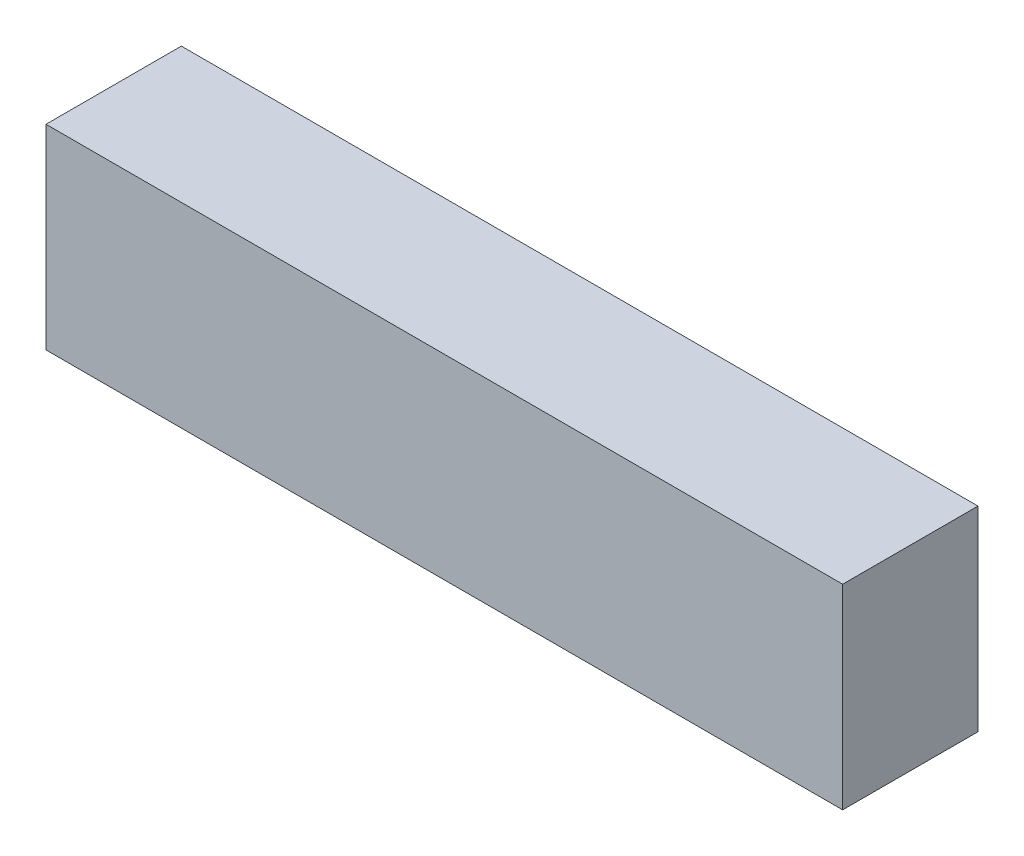
ISO-10303-21;
HEADER;
FILE_DESCRIPTION(('STEP AP214'),'2;1');
FILE_NAME('part.step','',(''),(''),'','','');
FILE_SCHEMA(('AUTOMOTIVE_DESIGN { 1 0 10303 214 1 1 1 1 }'));
ENDSEC;
DATA;
#1=APPLICATION_CONTEXT('core data for automotive mechanical design processes');
#2=APPLICATION_PROTOCOL_DEFINITION('international standard','automotive_design',2000,#1);
#3=PRODUCT_CONTEXT('',#1,'mechanical');
#4=PRODUCT('Part','Part','',(#3));
#5=PRODUCT_RELATED_PRODUCT_CATEGORY('part','',(#4));
#6=PRODUCT_DEFINITION_FORMATION('','',#4);
#7=PRODUCT_DEFINITION_CONTEXT('part definition',#1,'design');
#8=PRODUCT_DEFINITION('design','',#6,#7);
#9=PRODUCT_DEFINITION_SHAPE('','',#8);
#10=(LENGTH_UNIT() NAMED_UNIT(*) SI_UNIT(.MILLI.,.METRE.));
#11=(NAMED_UNIT(*) PLANE_ANGLE_UNIT() SI_UNIT($,.RADIAN.));
#12=(NAMED_UNIT(*) SI_UNIT($,.STERADIAN.) SOLID_ANGLE_UNIT());
#13=UNCERTAINTY_MEASURE_WITH_UNIT(LENGTH_MEASURE(1.E-05),#10,'distance_accuracy_value','');
#14=(GEOMETRIC_REPRESENTATION_CONTEXT(3) GLOBAL_UNCERTAINTY_ASSIGNED_CONTEXT((#13)) GLOBAL_UNIT_ASSIGNED_CONTEXT((#10,
#11,#12)) REPRESENTATION_CONTEXT('',''));
#15=CARTESIAN_POINT('',(0.,0.,0.));
#16=DIRECTION('',(0.,0.,1.));
#17=DIRECTION('',(1.,0.,0.));
#18=AXIS2_PLACEMENT_3D('',#15,#16,#17);
#19=CARTESIAN_POINT('',(-13.45000104,-3.30000102,4.57000102));
#20=DIRECTION('',(0.,0.,-1.));
#21=DIRECTION('',(-1.,0.,0.));
#22=AXIS2_PLACEMENT_3D('',#19,#20,#21);
#23=PLANE('',#22);
#24=DIRECTION('',(0.,1.,0.));
#25=VECTOR('',#24,1.);
#26=CARTESIAN_POINT('',(13.45000104,-3.30000102,4.57000102));
#27=LINE('',#26,#25);
#28=CARTESIAN_POINT('',(13.45000104,-3.30000102,4.57000102));
#29=VERTEX_POINT('',#28);
#30=CARTESIAN_POINT('',(13.45000104,3.30000102,4.57000102));
#31=VERTEX_POINT('',#30);
#32=EDGE_CURVE('E54',#29,#31,#27,.T.);
#33=ORIENTED_EDGE('',*,*,#32,.T.);
#34=DIRECTION('',(1.,0.,0.));
#35=VECTOR('',#34,1.);
#36=CARTESIAN_POINT('',(13.45000104,3.30000102,4.57000102));
#37=LINE('',#36,#35);
#38=CARTESIAN_POINT('',(-13.45000104,3.30000102,4.57000102));
#39=VERTEX_POINT('',#38);
#40=EDGE_CURVE('E56',#31,#39,#37,.F.);
#41=ORIENTED_EDGE('',*,*,#40,.T.);
#42=DIRECTION('',(0.,1.,0.));
#43=VECTOR('',#42,1.);
#44=CARTESIAN_POINT('',(-13.45000104,3.30000102,4.57000102));
#45=LINE('',#44,#43);
#46=CARTESIAN_POINT('',(-13.45000104,-3.30000102,4.57000102));
#47=VERTEX_POINT('',#46);
#48=EDGE_CURVE('E19',#39,#47,#45,.F.);
#49=ORIENTED_EDGE('',*,*,#48,.T.);
#50=DIRECTION('',(1.,0.,0.));
#51=VECTOR('',#50,1.);
#52=CARTESIAN_POINT('',(-13.45000104,-3.30000102,4.57000102));
#53=LINE('',#52,#51);
#54=EDGE_CURVE('E79',#47,#29,#53,.T.);
#55=ORIENTED_EDGE('',*,*,#54,.T.);
#56=EDGE_LOOP('',(#33,#41,#49,#55));
#57=FACE_BOUND('',#56,.T.);
#58=ADVANCED_FACE('F16',(#57),#23,.F.);
#59=CARTESIAN_POINT('',(-13.45000104,3.30000102,0.));
#60=DIRECTION('',(1.,0.,0.));
#61=DIRECTION('',(0.,0.,-1.));
#62=AXIS2_PLACEMENT_3D('',#59,#60,#61);
#63=PLANE('',#62);
#64=DIRECTION('',(0.,0.,1.));
#65=VECTOR('',#64,1.);
#66=CARTESIAN_POINT('',(-13.45000104,-3.30000102,0.));
#67=LINE('',#66,#65);
#68=CARTESIAN_POINT('',(-13.45000104,-3.30000102,0.));
#69=VERTEX_POINT('',#68);
#70=EDGE_CURVE('E67',#69,#47,#67,.T.);
#71=ORIENTED_EDGE('',*,*,#70,.T.);
#72=ORIENTED_EDGE('',*,*,#48,.F.);
#73=DIRECTION('',(0.,0.,-1.));
#74=VECTOR('',#73,1.);
#75=CARTESIAN_POINT('',(-13.45000104,3.30000102,0.));
#76=LINE('',#75,#74);
#77=CARTESIAN_POINT('',(-13.45000104,3.30000102,0.));
#78=VERTEX_POINT('',#77);
#79=EDGE_CURVE('E62',#39,#78,#76,.T.);
#80=ORIENTED_EDGE('',*,*,#79,.T.);
#81=DIRECTION('',(0.,1.,0.));
#82=VECTOR('',#81,1.);
#83=CARTESIAN_POINT('',(-13.45000104,-3.30000102,0.));
#84=LINE('',#83,#82);
#85=EDGE_CURVE('E82',#69,#78,#84,.T.);
#86=ORIENTED_EDGE('',*,*,#85,.F.);
#87=EDGE_LOOP('',(#71,#72,#80,#86));
#88=FACE_BOUND('',#87,.T.);
#89=ADVANCED_FACE('F64',(#88),#63,.F.);
#90=CARTESIAN_POINT('',(13.45000104,3.30000102,0.));
#91=DIRECTION('',(0.,-1.,0.));
#92=DIRECTION('',(0.,0.,-1.));
#93=AXIS2_PLACEMENT_3D('',#90,#91,#92);
#94=PLANE('',#93);
#95=ORIENTED_EDGE('',*,*,#79,.F.);
#96=ORIENTED_EDGE('',*,*,#40,.F.);
#97=DIRECTION('',(0.,0.,1.));
#98=VECTOR('',#97,1.);
#99=CARTESIAN_POINT('',(13.45000104,3.30000102,0.));
#100=LINE('',#99,#98);
#101=CARTESIAN_POINT('',(13.45000104,3.30000102,0.));
#102=VERTEX_POINT('',#101);
#103=EDGE_CURVE('E74',#31,#102,#100,.F.);
#104=ORIENTED_EDGE('',*,*,#103,.T.);
#105=DIRECTION('',(-1.,0.,0.));
#106=VECTOR('',#105,1.);
#107=CARTESIAN_POINT('',(-13.45000104,3.30000102,0.));
#108=LINE('',#107,#106);
#109=EDGE_CURVE('E71',#78,#102,#108,.F.);
#110=ORIENTED_EDGE('',*,*,#109,.F.);
#111=EDGE_LOOP('',(#95,#96,#104,#110));
#112=FACE_BOUND('',#111,.T.);
#113=ADVANCED_FACE('F69',(#112),#94,.F.);
#114=CARTESIAN_POINT('',(13.45000104,-3.30000102,0.));
#115=DIRECTION('',(-1.,0.,0.));
#116=DIRECTION('',(0.,0.,1.));
#117=AXIS2_PLACEMENT_3D('',#114,#115,#116);
#118=PLANE('',#117);
#119=ORIENTED_EDGE('',*,*,#103,.F.);
#120=ORIENTED_EDGE('',*,*,#32,.F.);
#121=DIRECTION('',(0.,0.,1.));
#122=VECTOR('',#121,1.);
#123=CARTESIAN_POINT('',(13.45000104,-3.30000102,0.));
#124=LINE('',#123,#122);
#125=CARTESIAN_POINT('',(13.45000104,-3.30000102,0.));
#126=VERTEX_POINT('',#125);
#127=EDGE_CURVE('E34',#29,#126,#124,.F.);
#128=ORIENTED_EDGE('',*,*,#127,.T.);
#129=DIRECTION('',(0.,1.,0.));
#130=VECTOR('',#129,1.);
#131=CARTESIAN_POINT('',(13.45000104,-3.30000102,0.));
#132=LINE('',#131,#130);
#133=EDGE_CURVE('E25',#102,#126,#132,.F.);
#134=ORIENTED_EDGE('',*,*,#133,.F.);
#135=EDGE_LOOP('',(#119,#120,#128,#134));
#136=FACE_BOUND('',#135,.T.);
#137=ADVANCED_FACE('F88',(#136),#118,.F.);
#138=CARTESIAN_POINT('',(-13.45000104,-3.30000102,0.));
#139=DIRECTION('',(0.,1.,0.));
#140=DIRECTION('',(0.,0.,1.));
#141=AXIS2_PLACEMENT_3D('',#138,#139,#140);
#142=PLANE('',#141);
#143=ORIENTED_EDGE('',*,*,#127,.F.);
#144=ORIENTED_EDGE('',*,*,#54,.F.);
#145=ORIENTED_EDGE('',*,*,#70,.F.);
#146=DIRECTION('',(-1.,0.,0.));
#147=VECTOR('',#146,1.);
#148=CARTESIAN_POINT('',(-13.45000104,-3.30000102,0.));
#149=LINE('',#148,#147);
#150=EDGE_CURVE('E10',#126,#69,#149,.T.);
#151=ORIENTED_EDGE('',*,*,#150,.F.);
#152=EDGE_LOOP('',(#143,#144,#145,#151));
#153=FACE_BOUND('',#152,.T.);
#154=ADVANCED_FACE('F90',(#153),#142,.F.);
#155=CARTESIAN_POINT('',(-13.45000104,-3.30000102,0.));
#156=DIRECTION('',(0.,0.,-1.));
#157=DIRECTION('',(-1.,0.,0.));
#158=AXIS2_PLACEMENT_3D('',#155,#156,#157);
#159=PLANE('',#158);
#160=ORIENTED_EDGE('',*,*,#133,.T.);
#161=ORIENTED_EDGE('',*,*,#150,.T.);
#162=ORIENTED_EDGE('',*,*,#85,.T.);
#163=ORIENTED_EDGE('',*,*,#109,.T.);
#164=EDGE_LOOP('',(#160,#161,#162,#163));
#165=FACE_BOUND('',#164,.T.);
#166=ADVANCED_FACE('F87',(#165),#159,.T.);
#167=CLOSED_SHELL('',(#58,#89,#113,#137,#154,#166));
#168=MANIFOLD_SOLID_BREP('B1',#167);
#169=ADVANCED_BREP_SHAPE_REPRESENTATION('',(#18,#168),#14);
#170=SHAPE_DEFINITION_REPRESENTATION(#9,#169);
ENDSEC;
END-ISO-10303-21;
